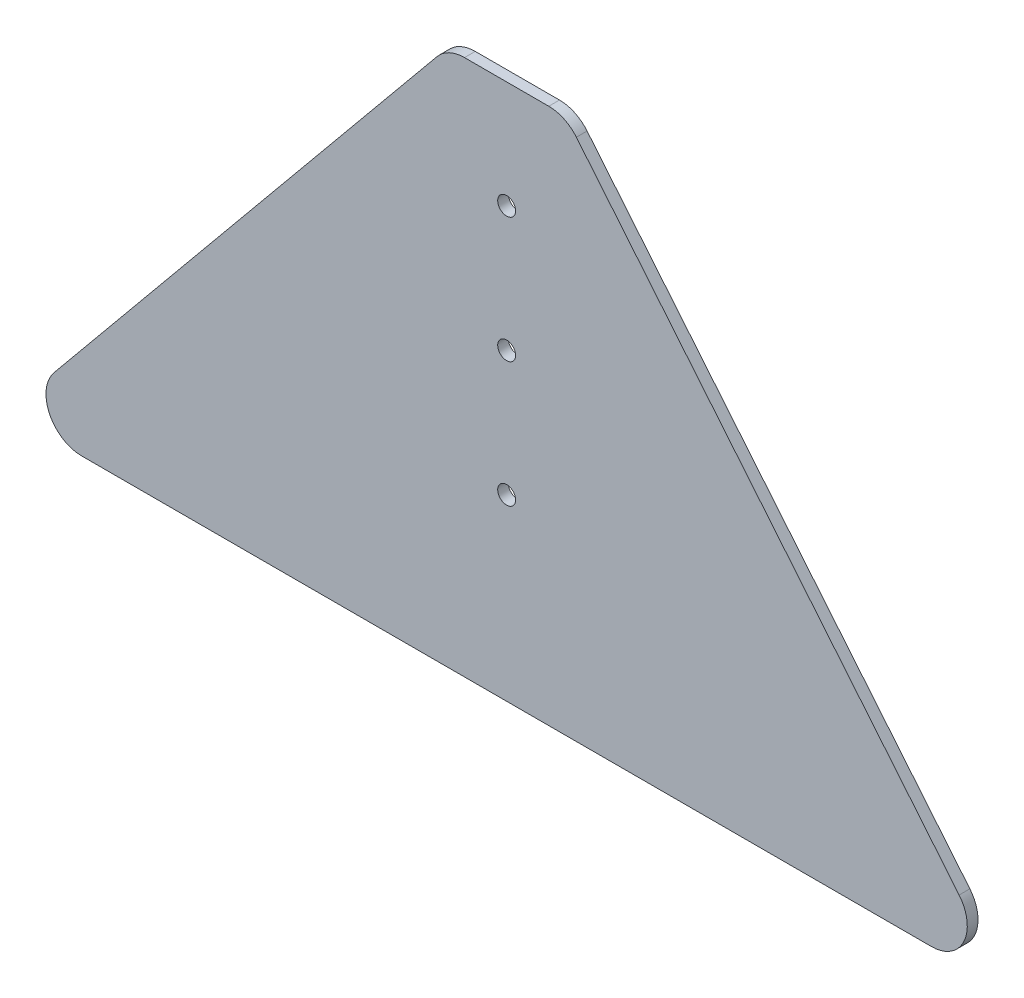
ISO-10303-21;
HEADER;
FILE_DESCRIPTION(('STEP AP214'),'2;1');
FILE_NAME('part.step','',(''),(''),'','','');
FILE_SCHEMA(('AUTOMOTIVE_DESIGN { 1 0 10303 214 1 1 1 1 }'));
ENDSEC;
DATA;
#1=APPLICATION_CONTEXT('core data for automotive mechanical design processes');
#2=APPLICATION_PROTOCOL_DEFINITION('international standard','automotive_design',2000,#1);
#3=PRODUCT_CONTEXT('',#1,'mechanical');
#4=PRODUCT('Part','Part','',(#3));
#5=PRODUCT_RELATED_PRODUCT_CATEGORY('part','',(#4));
#6=PRODUCT_DEFINITION_FORMATION('','',#4);
#7=PRODUCT_DEFINITION_CONTEXT('part definition',#1,'design');
#8=PRODUCT_DEFINITION('design','',#6,#7);
#9=PRODUCT_DEFINITION_SHAPE('','',#8);
#10=(LENGTH_UNIT() NAMED_UNIT(*) SI_UNIT(.MILLI.,.METRE.));
#11=(NAMED_UNIT(*) PLANE_ANGLE_UNIT() SI_UNIT($,.RADIAN.));
#12=(NAMED_UNIT(*) SI_UNIT($,.STERADIAN.) SOLID_ANGLE_UNIT());
#13=UNCERTAINTY_MEASURE_WITH_UNIT(LENGTH_MEASURE(1.E-05),#10,'distance_accuracy_value','');
#14=(GEOMETRIC_REPRESENTATION_CONTEXT(3) GLOBAL_UNCERTAINTY_ASSIGNED_CONTEXT((#13)) GLOBAL_UNIT_ASSIGNED_CONTEXT((#10,
#11,#12)) REPRESENTATION_CONTEXT('',''));
#15=CARTESIAN_POINT('',(0.,0.,0.));
#16=DIRECTION('',(0.,0.,1.));
#17=DIRECTION('',(1.,0.,0.));
#18=AXIS2_PLACEMENT_3D('',#15,#16,#17);
#19=CARTESIAN_POINT('',(0.,0.,3.));
#20=DIRECTION('',(0.,0.,-1.));
#21=DIRECTION('',(-1.,0.,0.));
#22=AXIS2_PLACEMENT_3D('',#19,#20,#21);
#23=PLANE('',#22);
#24=DIRECTION('',(-0.635617048681215,0.772004512568277,0.));
#25=VECTOR('',#24,1.);
#26=CARTESIAN_POINT('',(33.,150.,3.));
#27=LINE('',#26,#25);
#28=CARTESIAN_POINT('',(143.033419632525,16.3561704868122,3.));
#29=VERTEX_POINT('',#28);
#30=CARTESIAN_POINT('',(36.0000862991913,146.356170486812,3.));
#31=VERTEX_POINT('',#30);
#32=EDGE_CURVE('E200',#29,#31,#27,.T.);
#33=ORIENTED_EDGE('',*,*,#32,.T.);
#34=CARTESIAN_POINT('',(28.2800411735086,140.,3.));
#35=DIRECTION('',(0.,0.,-1.));
#36=DIRECTION('',(-1.,0.,0.));
#37=AXIS2_PLACEMENT_3D('',#34,#35,#36);
#38=CIRCLE('',#37,10.);
#39=CARTESIAN_POINT('',(28.2800411735086,150.,3.));
#40=VERTEX_POINT('',#39);
#41=EDGE_CURVE('E176',#31,#40,#38,.F.);
#42=ORIENTED_EDGE('',*,*,#41,.T.);
#43=DIRECTION('',(-1.,0.,0.));
#44=VECTOR('',#43,1.);
#45=CARTESIAN_POINT('',(0.,150.,3.));
#46=LINE('',#45,#44);
#47=CARTESIAN_POINT('',(4.71995882649142,150.,3.));
#48=VERTEX_POINT('',#47);
#49=EDGE_CURVE('E133',#40,#48,#46,.T.);
#50=ORIENTED_EDGE('',*,*,#49,.T.);
#51=CARTESIAN_POINT('',(4.71995882649142,140.,3.));
#52=DIRECTION('',(0.,0.,-1.));
#53=DIRECTION('',(-1.,0.,0.));
#54=AXIS2_PLACEMENT_3D('',#51,#52,#53);
#55=CIRCLE('',#54,10.);
#56=CARTESIAN_POINT('',(-3.00008629919134,146.356170486812,3.));
#57=VERTEX_POINT('',#56);
#58=EDGE_CURVE('E68',#48,#57,#55,.F.);
#59=ORIENTED_EDGE('',*,*,#58,.T.);
#60=DIRECTION('',(-0.635617048681215,-0.772004512568277,0.));
#61=VECTOR('',#60,1.);
#62=CARTESIAN_POINT('',(0.,150.,3.));
#63=LINE('',#62,#61);
#64=CARTESIAN_POINT('',(-110.033419632525,16.3561704868121,3.));
#65=VERTEX_POINT('',#64);
#66=EDGE_CURVE('E154',#57,#65,#63,.T.);
#67=ORIENTED_EDGE('',*,*,#66,.T.);
#68=CARTESIAN_POINT('',(-102.313374506842,9.99999999999996,3.));
#69=DIRECTION('',(0.,0.,-1.));
#70=DIRECTION('',(-1.,0.,0.));
#71=AXIS2_PLACEMENT_3D('',#68,#69,#70);
#72=CIRCLE('',#71,10.);
#73=CARTESIAN_POINT('',(-102.313374506842,0.,3.));
#74=VERTEX_POINT('',#73);
#75=EDGE_CURVE('E171',#65,#74,#72,.F.);
#76=ORIENTED_EDGE('',*,*,#75,.T.);
#77=DIRECTION('',(1.,0.,0.));
#78=VECTOR('',#77,1.);
#79=CARTESIAN_POINT('',(-123.5,0.,3.));
#80=LINE('',#79,#78);
#81=CARTESIAN_POINT('',(135.313374506842,0.,3.));
#82=VERTEX_POINT('',#81);
#83=EDGE_CURVE('E147',#74,#82,#80,.T.);
#84=ORIENTED_EDGE('',*,*,#83,.T.);
#85=CARTESIAN_POINT('',(135.313374506842,10.,3.));
#86=DIRECTION('',(0.,0.,-1.));
#87=DIRECTION('',(-1.,0.,0.));
#88=AXIS2_PLACEMENT_3D('',#85,#86,#87);
#89=CIRCLE('',#88,10.);
#90=EDGE_CURVE('E168',#82,#29,#89,.F.);
#91=ORIENTED_EDGE('',*,*,#90,.T.);
#92=EDGE_LOOP('',(#33,#42,#50,#59,#67,#76,#84,#91));
#93=FACE_BOUND('',#92,.T.);
#94=CARTESIAN_POINT('',(16.5,85.,3.));
#95=DIRECTION('',(0.,0.,1.));
#96=DIRECTION('',(1.,0.,0.));
#97=AXIS2_PLACEMENT_3D('',#94,#95,#96);
#98=CIRCLE('',#97,2.5);
#99=CARTESIAN_POINT('',(19.,85.,3.));
#100=VERTEX_POINT('',#99);
#101=EDGE_CURVE('E206',#100,#100,#98,.T.);
#102=ORIENTED_EDGE('',*,*,#101,.F.);
#103=EDGE_LOOP('',(#102));
#104=FACE_BOUND('',#103,.T.);
#105=CARTESIAN_POINT('',(16.5,120.,3.));
#106=DIRECTION('',(0.,0.,1.));
#107=DIRECTION('',(1.,0.,0.));
#108=AXIS2_PLACEMENT_3D('',#105,#106,#107);
#109=CIRCLE('',#108,2.5);
#110=CARTESIAN_POINT('',(19.,120.,3.));
#111=VERTEX_POINT('',#110);
#112=EDGE_CURVE('E220',#111,#111,#109,.T.);
#113=ORIENTED_EDGE('',*,*,#112,.F.);
#114=EDGE_LOOP('',(#113));
#115=FACE_BOUND('',#114,.T.);
#116=CARTESIAN_POINT('',(16.5,50.,3.));
#117=DIRECTION('',(0.,0.,1.));
#118=DIRECTION('',(1.,0.,0.));
#119=AXIS2_PLACEMENT_3D('',#116,#117,#118);
#120=CIRCLE('',#119,2.5);
#121=CARTESIAN_POINT('',(19.,50.,3.));
#122=VERTEX_POINT('',#121);
#123=EDGE_CURVE('E226',#122,#122,#120,.T.);
#124=ORIENTED_EDGE('',*,*,#123,.F.);
#125=EDGE_LOOP('',(#124));
#126=FACE_BOUND('',#125,.T.);
#127=ADVANCED_FACE('F45',(#93,#104,#115,#126),#23,.F.);
#128=CARTESIAN_POINT('',(0.,0.,0.));
#129=DIRECTION('',(0.,0.,-1.));
#130=DIRECTION('',(-1.,0.,0.));
#131=AXIS2_PLACEMENT_3D('',#128,#129,#130);
#132=PLANE('',#131);
#133=CARTESIAN_POINT('',(16.5,120.,0.));
#134=DIRECTION('',(0.,0.,1.));
#135=DIRECTION('',(1.,0.,0.));
#136=AXIS2_PLACEMENT_3D('',#133,#134,#135);
#137=CIRCLE('',#136,2.5);
#138=CARTESIAN_POINT('',(19.,120.,0.));
#139=VERTEX_POINT('',#138);
#140=EDGE_CURVE('E222',#139,#139,#137,.T.);
#141=ORIENTED_EDGE('',*,*,#140,.T.);
#142=EDGE_LOOP('',(#141));
#143=FACE_BOUND('',#142,.T.);
#144=DIRECTION('',(-1.,0.,0.));
#145=VECTOR('',#144,1.);
#146=CARTESIAN_POINT('',(0.,150.,0.));
#147=LINE('',#146,#145);
#148=CARTESIAN_POINT('',(28.2800411735086,150.,0.));
#149=VERTEX_POINT('',#148);
#150=CARTESIAN_POINT('',(4.71995882649142,150.,0.));
#151=VERTEX_POINT('',#150);
#152=EDGE_CURVE('E131',#149,#151,#147,.T.);
#153=ORIENTED_EDGE('',*,*,#152,.F.);
#154=CARTESIAN_POINT('',(28.2800411735086,140.,0.));
#155=DIRECTION('',(0.,0.,-1.));
#156=DIRECTION('',(-1.,0.,0.));
#157=AXIS2_PLACEMENT_3D('',#154,#155,#156);
#158=CIRCLE('',#157,10.);
#159=CARTESIAN_POINT('',(36.0000862991913,146.356170486812,0.));
#160=VERTEX_POINT('',#159);
#161=EDGE_CURVE('E113',#149,#160,#158,.T.);
#162=ORIENTED_EDGE('',*,*,#161,.T.);
#163=DIRECTION('',(-0.635617048681215,0.772004512568277,0.));
#164=VECTOR('',#163,1.);
#165=CARTESIAN_POINT('',(33.,150.,0.));
#166=LINE('',#165,#164);
#167=CARTESIAN_POINT('',(143.033419632525,16.3561704868122,0.));
#168=VERTEX_POINT('',#167);
#169=EDGE_CURVE('E143',#168,#160,#166,.T.);
#170=ORIENTED_EDGE('',*,*,#169,.F.);
#171=CARTESIAN_POINT('',(135.313374506842,10.,0.));
#172=DIRECTION('',(0.,0.,-1.));
#173=DIRECTION('',(-1.,0.,0.));
#174=AXIS2_PLACEMENT_3D('',#171,#172,#173);
#175=CIRCLE('',#174,10.);
#176=CARTESIAN_POINT('',(135.313374506842,0.,0.));
#177=VERTEX_POINT('',#176);
#178=EDGE_CURVE('E135',#168,#177,#175,.T.);
#179=ORIENTED_EDGE('',*,*,#178,.T.);
#180=DIRECTION('',(1.,0.,0.));
#181=VECTOR('',#180,1.);
#182=CARTESIAN_POINT('',(156.5,0.,0.));
#183=LINE('',#182,#181);
#184=CARTESIAN_POINT('',(-102.313374506842,0.,0.));
#185=VERTEX_POINT('',#184);
#186=EDGE_CURVE('E149',#185,#177,#183,.T.);
#187=ORIENTED_EDGE('',*,*,#186,.F.);
#188=CARTESIAN_POINT('',(-102.313374506842,9.99999999999996,0.));
#189=DIRECTION('',(0.,0.,-1.));
#190=DIRECTION('',(-1.,0.,0.));
#191=AXIS2_PLACEMENT_3D('',#188,#189,#190);
#192=CIRCLE('',#191,10.);
#193=CARTESIAN_POINT('',(-110.033419632525,16.3561704868121,0.));
#194=VERTEX_POINT('',#193);
#195=EDGE_CURVE('E158',#185,#194,#192,.T.);
#196=ORIENTED_EDGE('',*,*,#195,.T.);
#197=DIRECTION('',(-0.635617048681215,-0.772004512568277,0.));
#198=VECTOR('',#197,1.);
#199=CARTESIAN_POINT('',(0.,150.,0.));
#200=LINE('',#199,#198);
#201=CARTESIAN_POINT('',(-3.00008629919134,146.356170486812,0.));
#202=VERTEX_POINT('',#201);
#203=EDGE_CURVE('E142',#202,#194,#200,.T.);
#204=ORIENTED_EDGE('',*,*,#203,.F.);
#205=CARTESIAN_POINT('',(4.71995882649142,140.,0.));
#206=DIRECTION('',(0.,0.,-1.));
#207=DIRECTION('',(-1.,0.,0.));
#208=AXIS2_PLACEMENT_3D('',#205,#206,#207);
#209=CIRCLE('',#208,10.);
#210=EDGE_CURVE('E125',#202,#151,#209,.T.);
#211=ORIENTED_EDGE('',*,*,#210,.T.);
#212=EDGE_LOOP('',(#153,#162,#170,#179,#187,#196,#204,#211));
#213=FACE_BOUND('',#212,.T.);
#214=CARTESIAN_POINT('',(16.5,85.,0.));
#215=DIRECTION('',(0.,0.,1.));
#216=DIRECTION('',(1.,0.,0.));
#217=AXIS2_PLACEMENT_3D('',#214,#215,#216);
#218=CIRCLE('',#217,2.5);
#219=CARTESIAN_POINT('',(19.,85.,0.));
#220=VERTEX_POINT('',#219);
#221=EDGE_CURVE('E209',#220,#220,#218,.T.);
#222=ORIENTED_EDGE('',*,*,#221,.T.);
#223=EDGE_LOOP('',(#222));
#224=FACE_BOUND('',#223,.T.);
#225=CARTESIAN_POINT('',(16.5,50.,0.));
#226=DIRECTION('',(0.,0.,1.));
#227=DIRECTION('',(1.,0.,0.));
#228=AXIS2_PLACEMENT_3D('',#225,#226,#227);
#229=CIRCLE('',#228,2.5);
#230=CARTESIAN_POINT('',(19.,50.,0.));
#231=VERTEX_POINT('',#230);
#232=EDGE_CURVE('E230',#231,#231,#229,.T.);
#233=ORIENTED_EDGE('',*,*,#232,.T.);
#234=EDGE_LOOP('',(#233));
#235=FACE_BOUND('',#234,.T.);
#236=ADVANCED_FACE('F138',(#143,#213,#224,#235),#132,.T.);
#237=CARTESIAN_POINT('',(156.5,0.,3.));
#238=DIRECTION('',(0.,1.,0.));
#239=DIRECTION('',(-1.,0.,0.));
#240=AXIS2_PLACEMENT_3D('',#237,#238,#239);
#241=PLANE('',#240);
#242=ORIENTED_EDGE('',*,*,#83,.F.);
#243=DIRECTION('',(0.,0.,-1.));
#244=VECTOR('',#243,1.);
#245=CARTESIAN_POINT('',(-102.313374506842,0.,3.));
#246=LINE('',#245,#244);
#247=EDGE_CURVE('E11',#74,#185,#246,.T.);
#248=ORIENTED_EDGE('',*,*,#247,.T.);
#249=ORIENTED_EDGE('',*,*,#186,.T.);
#250=DIRECTION('',(0.,0.,-1.));
#251=VECTOR('',#250,1.);
#252=CARTESIAN_POINT('',(135.313374506842,0.,3.));
#253=LINE('',#252,#251);
#254=EDGE_CURVE('E54',#177,#82,#253,.F.);
#255=ORIENTED_EDGE('',*,*,#254,.T.);
#256=EDGE_LOOP('',(#242,#248,#249,#255));
#257=FACE_BOUND('',#256,.T.);
#258=ADVANCED_FACE('F190',(#257),#241,.F.);
#259=CARTESIAN_POINT('',(33.,150.,3.));
#260=DIRECTION('',(-0.772004512568276,-0.635617048681215,0.));
#261=DIRECTION('',(0.635617048681215,-0.772004512568277,0.));
#262=AXIS2_PLACEMENT_3D('',#259,#260,#261);
#263=PLANE('',#262);
#264=ORIENTED_EDGE('',*,*,#169,.T.);
#265=DIRECTION('',(0.,0.,-1.));
#266=VECTOR('',#265,1.);
#267=CARTESIAN_POINT('',(36.0000862991913,146.356170486812,3.));
#268=LINE('',#267,#266);
#269=EDGE_CURVE('E118',#160,#31,#268,.F.);
#270=ORIENTED_EDGE('',*,*,#269,.T.);
#271=ORIENTED_EDGE('',*,*,#32,.F.);
#272=DIRECTION('',(0.,0.,-1.));
#273=VECTOR('',#272,1.);
#274=CARTESIAN_POINT('',(143.033419632525,16.3561704868122,3.));
#275=LINE('',#274,#273);
#276=EDGE_CURVE('E124',#29,#168,#275,.T.);
#277=ORIENTED_EDGE('',*,*,#276,.T.);
#278=EDGE_LOOP('',(#264,#270,#271,#277));
#279=FACE_BOUND('',#278,.T.);
#280=ADVANCED_FACE('F204',(#279),#263,.F.);
#281=CARTESIAN_POINT('',(0.,150.,3.));
#282=DIRECTION('',(0.,-1.,0.));
#283=DIRECTION('',(0.,0.,-1.));
#284=AXIS2_PLACEMENT_3D('',#281,#282,#283);
#285=PLANE('',#284);
#286=ORIENTED_EDGE('',*,*,#49,.F.);
#287=DIRECTION('',(0.,0.,-1.));
#288=VECTOR('',#287,1.);
#289=CARTESIAN_POINT('',(28.2800411735086,150.,3.));
#290=LINE('',#289,#288);
#291=EDGE_CURVE('E117',#40,#149,#290,.T.);
#292=ORIENTED_EDGE('',*,*,#291,.T.);
#293=ORIENTED_EDGE('',*,*,#152,.T.);
#294=DIRECTION('',(0.,0.,-1.));
#295=VECTOR('',#294,1.);
#296=CARTESIAN_POINT('',(4.71995882649142,150.,3.));
#297=LINE('',#296,#295);
#298=EDGE_CURVE('E136',#151,#48,#297,.F.);
#299=ORIENTED_EDGE('',*,*,#298,.T.);
#300=EDGE_LOOP('',(#286,#292,#293,#299));
#301=FACE_BOUND('',#300,.T.);
#302=ADVANCED_FACE('F130',(#301),#285,.F.);
#303=CARTESIAN_POINT('',(0.,150.,3.));
#304=DIRECTION('',(0.772004512568277,-0.635617048681214,0.));
#305=DIRECTION('',(0.635617048681215,0.772004512568277,0.));
#306=AXIS2_PLACEMENT_3D('',#303,#304,#305);
#307=PLANE('',#306);
#308=ORIENTED_EDGE('',*,*,#66,.F.);
#309=DIRECTION('',(0.,0.,-1.));
#310=VECTOR('',#309,1.);
#311=CARTESIAN_POINT('',(-3.00008629919134,146.356170486812,3.));
#312=LINE('',#311,#310);
#313=EDGE_CURVE('E181',#57,#202,#312,.T.);
#314=ORIENTED_EDGE('',*,*,#313,.T.);
#315=ORIENTED_EDGE('',*,*,#203,.T.);
#316=DIRECTION('',(0.,0.,-1.));
#317=VECTOR('',#316,1.);
#318=CARTESIAN_POINT('',(-110.033419632525,16.3561704868121,3.));
#319=LINE('',#318,#317);
#320=EDGE_CURVE('E61',#194,#65,#319,.F.);
#321=ORIENTED_EDGE('',*,*,#320,.T.);
#322=EDGE_LOOP('',(#308,#314,#315,#321));
#323=FACE_BOUND('',#322,.T.);
#324=ADVANCED_FACE('F252',(#323),#307,.F.);
#325=CARTESIAN_POINT('',(16.5,85.,3.));
#326=DIRECTION('',(0.,0.,-1.));
#327=DIRECTION('',(-1.,0.,0.));
#328=AXIS2_PLACEMENT_3D('',#325,#326,#327);
#329=CYLINDRICAL_SURFACE('',#328,2.5);
#330=ORIENTED_EDGE('',*,*,#101,.T.);
#331=EDGE_LOOP('',(#330));
#332=FACE_BOUND('',#331,.T.);
#333=ORIENTED_EDGE('',*,*,#221,.F.);
#334=EDGE_LOOP('',(#333));
#335=FACE_BOUND('',#334,.T.);
#336=ADVANCED_FACE('F249',(#332,#335),#329,.F.);
#337=CARTESIAN_POINT('',(16.5,120.,3.));
#338=DIRECTION('',(0.,0.,-1.));
#339=DIRECTION('',(-1.,0.,0.));
#340=AXIS2_PLACEMENT_3D('',#337,#338,#339);
#341=CYLINDRICAL_SURFACE('',#340,2.5);
#342=ORIENTED_EDGE('',*,*,#112,.T.);
#343=EDGE_LOOP('',(#342));
#344=FACE_BOUND('',#343,.T.);
#345=ORIENTED_EDGE('',*,*,#140,.F.);
#346=EDGE_LOOP('',(#345));
#347=FACE_BOUND('',#346,.T.);
#348=ADVANCED_FACE('F300',(#344,#347),#341,.F.);
#349=CARTESIAN_POINT('',(16.5,50.,3.));
#350=DIRECTION('',(0.,0.,-1.));
#351=DIRECTION('',(-1.,0.,0.));
#352=AXIS2_PLACEMENT_3D('',#349,#350,#351);
#353=CYLINDRICAL_SURFACE('',#352,2.5);
#354=ORIENTED_EDGE('',*,*,#123,.T.);
#355=EDGE_LOOP('',(#354));
#356=FACE_BOUND('',#355,.T.);
#357=ORIENTED_EDGE('',*,*,#232,.F.);
#358=EDGE_LOOP('',(#357));
#359=FACE_BOUND('',#358,.T.);
#360=ADVANCED_FACE('F238',(#356,#359),#353,.F.);
#361=CARTESIAN_POINT('',(28.2800411735086,140.,3.));
#362=DIRECTION('',(0.,0.,-1.));
#363=DIRECTION('',(-1.,0.,0.));
#364=AXIS2_PLACEMENT_3D('',#361,#362,#363);
#365=CYLINDRICAL_SURFACE('',#364,10.);
#366=ORIENTED_EDGE('',*,*,#41,.F.);
#367=ORIENTED_EDGE('',*,*,#269,.F.);
#368=ORIENTED_EDGE('',*,*,#161,.F.);
#369=ORIENTED_EDGE('',*,*,#291,.F.);
#370=EDGE_LOOP('',(#366,#367,#368,#369));
#371=FACE_BOUND('',#370,.T.);
#372=ADVANCED_FACE('F116',(#371),#365,.T.);
#373=CARTESIAN_POINT('',(4.71995882649142,140.,3.));
#374=DIRECTION('',(0.,0.,-1.));
#375=DIRECTION('',(-1.,0.,0.));
#376=AXIS2_PLACEMENT_3D('',#373,#374,#375);
#377=CYLINDRICAL_SURFACE('',#376,10.);
#378=ORIENTED_EDGE('',*,*,#58,.F.);
#379=ORIENTED_EDGE('',*,*,#298,.F.);
#380=ORIENTED_EDGE('',*,*,#210,.F.);
#381=ORIENTED_EDGE('',*,*,#313,.F.);
#382=EDGE_LOOP('',(#378,#379,#380,#381));
#383=FACE_BOUND('',#382,.T.);
#384=ADVANCED_FACE('F263',(#383),#377,.T.);
#385=CARTESIAN_POINT('',(-102.313374506842,9.99999999999996,3.));
#386=DIRECTION('',(0.,0.,-1.));
#387=DIRECTION('',(-1.,0.,0.));
#388=AXIS2_PLACEMENT_3D('',#385,#386,#387);
#389=CYLINDRICAL_SURFACE('',#388,10.);
#390=ORIENTED_EDGE('',*,*,#75,.F.);
#391=ORIENTED_EDGE('',*,*,#320,.F.);
#392=ORIENTED_EDGE('',*,*,#195,.F.);
#393=ORIENTED_EDGE('',*,*,#247,.F.);
#394=EDGE_LOOP('',(#390,#391,#392,#393));
#395=FACE_BOUND('',#394,.T.);
#396=ADVANCED_FACE('F265',(#395),#389,.T.);
#397=CARTESIAN_POINT('',(135.313374506842,10.,3.));
#398=DIRECTION('',(0.,0.,-1.));
#399=DIRECTION('',(-1.,0.,0.));
#400=AXIS2_PLACEMENT_3D('',#397,#398,#399);
#401=CYLINDRICAL_SURFACE('',#400,10.);
#402=ORIENTED_EDGE('',*,*,#90,.F.);
#403=ORIENTED_EDGE('',*,*,#254,.F.);
#404=ORIENTED_EDGE('',*,*,#178,.F.);
#405=ORIENTED_EDGE('',*,*,#276,.F.);
#406=EDGE_LOOP('',(#402,#403,#404,#405));
#407=FACE_BOUND('',#406,.T.);
#408=ADVANCED_FACE('F47',(#407),#401,.T.);
#409=CLOSED_SHELL('',(#127,#236,#258,#280,#302,#324,#336,#348,#360,#372,#384,#396,#408));
#410=MANIFOLD_SOLID_BREP('B2',#409);
#411=ADVANCED_BREP_SHAPE_REPRESENTATION('',(#18,#410),#14);
#412=SHAPE_DEFINITION_REPRESENTATION(#9,#411);
ENDSEC;
END-ISO-10303-21;
